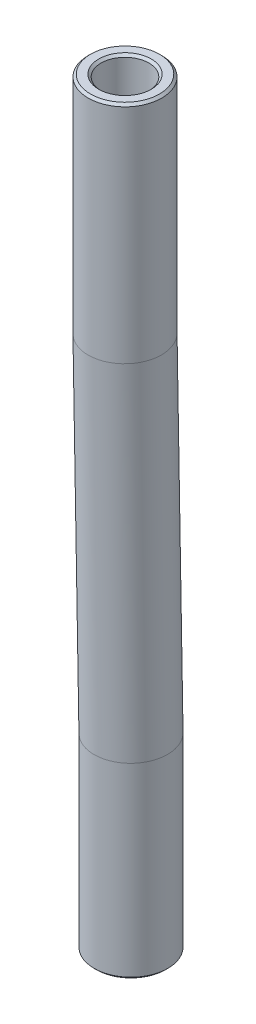
ISO-10303-21;
HEADER;
FILE_DESCRIPTION(('STEP AP214'),'2;1');
FILE_NAME('part.step','',(''),(''),'','','');
FILE_SCHEMA(('AUTOMOTIVE_DESIGN { 1 0 10303 214 1 1 1 1 }'));
ENDSEC;
DATA;
#1=APPLICATION_CONTEXT('core data for automotive mechanical design processes');
#2=APPLICATION_PROTOCOL_DEFINITION('international standard','automotive_design',2000,#1);
#3=PRODUCT_CONTEXT('',#1,'mechanical');
#4=PRODUCT('Part','Part','',(#3));
#5=PRODUCT_RELATED_PRODUCT_CATEGORY('part','',(#4));
#6=PRODUCT_DEFINITION_FORMATION('','',#4);
#7=PRODUCT_DEFINITION_CONTEXT('part definition',#1,'design');
#8=PRODUCT_DEFINITION('design','',#6,#7);
#9=PRODUCT_DEFINITION_SHAPE('','',#8);
#10=(LENGTH_UNIT() NAMED_UNIT(*) SI_UNIT(.MILLI.,.METRE.));
#11=(NAMED_UNIT(*) PLANE_ANGLE_UNIT() SI_UNIT($,.RADIAN.));
#12=(NAMED_UNIT(*) SI_UNIT($,.STERADIAN.) SOLID_ANGLE_UNIT());
#13=UNCERTAINTY_MEASURE_WITH_UNIT(LENGTH_MEASURE(1.E-05),#10,'distance_accuracy_value','');
#14=(GEOMETRIC_REPRESENTATION_CONTEXT(3) GLOBAL_UNCERTAINTY_ASSIGNED_CONTEXT((#13)) GLOBAL_UNIT_ASSIGNED_CONTEXT((#10,
#11,#12)) REPRESENTATION_CONTEXT('',''));
#15=CARTESIAN_POINT('',(0.,0.,0.));
#16=DIRECTION('',(0.,0.,1.));
#17=DIRECTION('',(1.,0.,0.));
#18=AXIS2_PLACEMENT_3D('',#15,#16,#17);
#19=CARTESIAN_POINT('',(93.8249999999999,-74.525,25.85));
#20=DIRECTION('',(0.,1.,0.));
#21=DIRECTION('',(0.,0.,1.));
#22=AXIS2_PLACEMENT_3D('',#19,#20,#21);
#23=CYLINDRICAL_SURFACE('',#22,2.);
#24=CARTESIAN_POINT('',(93.8249999999999,-62.252,25.85));
#25=DIRECTION('',(0.,1.,0.));
#26=DIRECTION('',(0.,0.,1.));
#27=AXIS2_PLACEMENT_3D('',#24,#25,#26);
#28=CIRCLE('',#27,2.);
#29=CARTESIAN_POINT('',(93.8249999999999,-62.252,27.85));
#30=VERTEX_POINT('',#29);
#31=EDGE_CURVE('E42',#30,#30,#28,.F.);
#32=ORIENTED_EDGE('',*,*,#31,.T.);
#33=EDGE_LOOP('',(#32));
#34=FACE_BOUND('',#33,.T.);
#35=CARTESIAN_POINT('',(93.8249999999999,-74.325,25.8499999999999));
#36=DIRECTION('',(0.,0.999963268554836,0.00857097083934706));
#37=DIRECTION('',(-1.01197381520543E-11,-0.00857097083934706,0.999963268554836));
#38=AXIS2_PLACEMENT_3D('',#35,#36,#37);
#39=ELLIPSE('',#38,2.00007346558882,2.);
#40=CARTESIAN_POINT('',(93.8249999999797,-74.3421425713501,27.8499999999999));
#41=VERTEX_POINT('',#40);
#42=EDGE_CURVE('E59',#41,#41,#39,.F.);
#43=ORIENTED_EDGE('',*,*,#42,.F.);
#44=EDGE_LOOP('',(#43));
#45=FACE_BOUND('',#44,.T.);
#46=ADVANCED_FACE('F33',(#34,#45),#23,.T.);
#47=CARTESIAN_POINT('',(93.8250000000032,-93.4822271790501,25.5215717375939));
#48=DIRECTION('',(-1.73471961206171E-13,0.999853076917742,0.0171413120304033));
#49=DIRECTION('',(0.,-0.0171413120304033,0.999853076917742));
#50=AXIS2_PLACEMENT_3D('',#47,#48,#49);
#51=CYLINDRICAL_SURFACE('',#50,2.);
#52=CARTESIAN_POINT('',(93.8250000000032,-93.2822565636665,25.525));
#53=DIRECTION('',(0.,0.999963268554836,0.00857097083934706));
#54=DIRECTION('',(1.01197381520543E-11,0.00857097083934706,-0.999963268554836));
#55=AXIS2_PLACEMENT_3D('',#52,#53,#54);
#56=ELLIPSE('',#55,2.00007346558882,2.);
#57=CARTESIAN_POINT('',(93.8250000000234,-93.2651139923164,23.525));
#58=VERTEX_POINT('',#57);
#59=EDGE_CURVE('E55',#58,#58,#56,.F.);
#60=ORIENTED_EDGE('',*,*,#59,.F.);
#61=EDGE_LOOP('',(#60));
#62=FACE_BOUND('',#61,.T.);
#63=ORIENTED_EDGE('',*,*,#42,.T.);
#64=EDGE_LOOP('',(#63));
#65=FACE_BOUND('',#64,.T.);
#66=ADVANCED_FACE('F131',(#62,#65),#51,.T.);
#67=CARTESIAN_POINT('',(93.8250000000032,-103.482256563667,25.525));
#68=DIRECTION('',(0.,1.,0.));
#69=DIRECTION('',(0.,0.,1.));
#70=AXIS2_PLACEMENT_3D('',#67,#68,#69);
#71=CYLINDRICAL_SURFACE('',#70,2.);
#72=CARTESIAN_POINT('',(93.8250000000032,-103.355256563667,25.525));
#73=DIRECTION('',(0.,1.,0.));
#74=DIRECTION('',(0.,0.,1.));
#75=AXIS2_PLACEMENT_3D('',#72,#73,#74);
#76=CIRCLE('',#75,2.);
#77=CARTESIAN_POINT('',(93.8250000000032,-103.355256563667,27.525));
#78=VERTEX_POINT('',#77);
#79=EDGE_CURVE('E65',#78,#78,#76,.T.);
#80=ORIENTED_EDGE('',*,*,#79,.T.);
#81=EDGE_LOOP('',(#80));
#82=FACE_BOUND('',#81,.T.);
#83=ORIENTED_EDGE('',*,*,#59,.T.);
#84=EDGE_LOOP('',(#83));
#85=FACE_BOUND('',#84,.T.);
#86=ADVANCED_FACE('F97',(#82,#85),#71,.T.);
#87=CARTESIAN_POINT('',(93.8249999999999,-62.125,25.85));
#88=DIRECTION('',(0.,1.,0.));
#89=DIRECTION('',(-1.,0.,0.));
#90=AXIS2_PLACEMENT_3D('',#87,#88,#89);
#91=PLANE('',#90);
#92=CARTESIAN_POINT('',(93.8249999999999,-62.125,25.85));
#93=DIRECTION('',(0.,1.,0.));
#94=DIRECTION('',(-1.,0.,0.));
#95=AXIS2_PLACEMENT_3D('',#92,#93,#94);
#96=CIRCLE('',#95,1.87300000000001);
#97=CARTESIAN_POINT('',(91.9519999999999,-62.125,25.85));
#98=VERTEX_POINT('',#97);
#99=EDGE_CURVE('E81',#98,#98,#96,.T.);
#100=ORIENTED_EDGE('',*,*,#99,.T.);
#101=EDGE_LOOP('',(#100));
#102=FACE_BOUND('',#101,.T.);
#103=CARTESIAN_POINT('',(93.8249999999999,-62.125,25.85));
#104=DIRECTION('',(0.,1.,0.));
#105=DIRECTION('',(-1.,0.,0.));
#106=AXIS2_PLACEMENT_3D('',#103,#104,#105);
#107=CIRCLE('',#106,1.42699999999997);
#108=CARTESIAN_POINT('',(92.3979999999999,-62.125,25.85));
#109=VERTEX_POINT('',#108);
#110=EDGE_CURVE('E78',#109,#109,#107,.F.);
#111=ORIENTED_EDGE('',*,*,#110,.T.);
#112=EDGE_LOOP('',(#111));
#113=FACE_BOUND('',#112,.T.);
#114=ADVANCED_FACE('F93',(#102,#113),#91,.T.);
#115=CARTESIAN_POINT('',(93.8250000000032,-103.482256563667,25.525));
#116=DIRECTION('',(0.,1.,0.));
#117=DIRECTION('',(-1.,0.,0.));
#118=AXIS2_PLACEMENT_3D('',#115,#116,#117);
#119=PLANE('',#118);
#120=CARTESIAN_POINT('',(93.8250000000032,-103.482256563667,25.525));
#121=DIRECTION('',(0.,1.,0.));
#122=DIRECTION('',(-1.,0.,0.));
#123=AXIS2_PLACEMENT_3D('',#120,#121,#122);
#124=CIRCLE('',#123,1.87299999999999);
#125=CARTESIAN_POINT('',(91.9520000000032,-103.482256563667,25.525));
#126=VERTEX_POINT('',#125);
#127=EDGE_CURVE('E72',#126,#126,#124,.F.);
#128=ORIENTED_EDGE('',*,*,#127,.T.);
#129=EDGE_LOOP('',(#128));
#130=FACE_BOUND('',#129,.T.);
#131=CARTESIAN_POINT('',(93.8250000000032,-103.482256563667,25.525));
#132=DIRECTION('',(0.,1.,0.));
#133=DIRECTION('',(-1.,0.,0.));
#134=AXIS2_PLACEMENT_3D('',#131,#132,#133);
#135=CIRCLE('',#134,1.42700000000001);
#136=CARTESIAN_POINT('',(92.3980000000032,-103.482256563667,25.525));
#137=VERTEX_POINT('',#136);
#138=EDGE_CURVE('E68',#137,#137,#135,.T.);
#139=ORIENTED_EDGE('',*,*,#138,.T.);
#140=EDGE_LOOP('',(#139));
#141=FACE_BOUND('',#140,.T.);
#142=ADVANCED_FACE('F96',(#130,#141),#119,.F.);
#143=CARTESIAN_POINT('',(93.8249999999999,-74.525,25.85));
#144=DIRECTION('',(0.,1.,0.));
#145=DIRECTION('',(0.,0.,1.));
#146=AXIS2_PLACEMENT_3D('',#143,#144,#145);
#147=CYLINDRICAL_SURFACE('',#146,1.29999999999999);
#148=CARTESIAN_POINT('',(93.8249999999999,-62.252,25.85));
#149=DIRECTION('',(0.,1.,0.));
#150=DIRECTION('',(0.,0.,1.));
#151=AXIS2_PLACEMENT_3D('',#148,#149,#150);
#152=CIRCLE('',#151,1.29999999999999);
#153=CARTESIAN_POINT('',(93.8249999999999,-62.252,27.1499999999999));
#154=VERTEX_POINT('',#153);
#155=EDGE_CURVE('E11',#154,#154,#152,.T.);
#156=ORIENTED_EDGE('',*,*,#155,.T.);
#157=EDGE_LOOP('',(#156));
#158=FACE_BOUND('',#157,.T.);
#159=CARTESIAN_POINT('',(93.8249999999999,-74.325,25.8499999999999));
#160=DIRECTION('',(0.,0.999963268554836,0.00857097083934706));
#161=DIRECTION('',(-1.01197381520543E-11,-0.00857097083934706,0.999963268554836));
#162=AXIS2_PLACEMENT_3D('',#159,#160,#161);
#163=ELLIPSE('',#162,1.30004775263273,1.29999999999999);
#164=CARTESIAN_POINT('',(93.8249999999868,-74.3361426713776,27.1499999999999));
#165=VERTEX_POINT('',#164);
#166=EDGE_CURVE('E48',#165,#165,#163,.T.);
#167=ORIENTED_EDGE('',*,*,#166,.F.);
#168=EDGE_LOOP('',(#167));
#169=FACE_BOUND('',#168,.T.);
#170=ADVANCED_FACE('F118',(#158,#169),#147,.F.);
#171=CARTESIAN_POINT('',(93.8250000000032,-93.4822271790501,25.5215717375939));
#172=DIRECTION('',(-1.73471961206171E-13,0.999853076917742,0.0171413120304033));
#173=DIRECTION('',(0.,-0.0171413120304033,0.999853076917742));
#174=AXIS2_PLACEMENT_3D('',#171,#172,#173);
#175=CYLINDRICAL_SURFACE('',#174,1.29999999999999);
#176=CARTESIAN_POINT('',(93.8250000000032,-93.2822565636665,25.525));
#177=DIRECTION('',(0.,0.999963268554836,0.00857097083934706));
#178=DIRECTION('',(1.01197381520543E-11,0.00857097083934706,-0.999963268554836));
#179=AXIS2_PLACEMENT_3D('',#176,#177,#178);
#180=ELLIPSE('',#179,1.30004775263273,1.29999999999999);
#181=CARTESIAN_POINT('',(93.8250000000163,-93.271113892289,24.225));
#182=VERTEX_POINT('',#181);
#183=EDGE_CURVE('E69',#182,#182,#180,.T.);
#184=ORIENTED_EDGE('',*,*,#183,.F.);
#185=EDGE_LOOP('',(#184));
#186=FACE_BOUND('',#185,.T.);
#187=ORIENTED_EDGE('',*,*,#166,.T.);
#188=EDGE_LOOP('',(#187));
#189=FACE_BOUND('',#188,.T.);
#190=ADVANCED_FACE('F109',(#186,#189),#175,.F.);
#191=CARTESIAN_POINT('',(93.8250000000032,-103.482256563667,25.525));
#192=DIRECTION('',(0.,1.,0.));
#193=DIRECTION('',(0.,0.,1.));
#194=AXIS2_PLACEMENT_3D('',#191,#192,#193);
#195=CYLINDRICAL_SURFACE('',#194,1.29999999999999);
#196=CARTESIAN_POINT('',(93.8250000000032,-103.355256563667,25.525));
#197=DIRECTION('',(0.,1.,0.));
#198=DIRECTION('',(0.,0.,1.));
#199=AXIS2_PLACEMENT_3D('',#196,#197,#198);
#200=CIRCLE('',#199,1.29999999999999);
#201=CARTESIAN_POINT('',(93.8250000000032,-103.355256563667,26.825));
#202=VERTEX_POINT('',#201);
#203=EDGE_CURVE('E75',#202,#202,#200,.F.);
#204=ORIENTED_EDGE('',*,*,#203,.T.);
#205=EDGE_LOOP('',(#204));
#206=FACE_BOUND('',#205,.T.);
#207=ORIENTED_EDGE('',*,*,#183,.T.);
#208=EDGE_LOOP('',(#207));
#209=FACE_BOUND('',#208,.T.);
#210=ADVANCED_FACE('F106',(#206,#209),#195,.F.);
#211=CARTESIAN_POINT('',(93.8250000000032,-103.355256563667,25.525));
#212=DIRECTION('',(0.,1.,0.));
#213=DIRECTION('',(0.,0.,1.));
#214=AXIS2_PLACEMENT_3D('',#211,#212,#213);
#215=CONICAL_SURFACE('',#214,2.,0.785398163397537);
#216=ORIENTED_EDGE('',*,*,#127,.F.);
#217=EDGE_LOOP('',(#216));
#218=FACE_BOUND('',#217,.T.);
#219=ORIENTED_EDGE('',*,*,#79,.F.);
#220=EDGE_LOOP('',(#219));
#221=FACE_BOUND('',#220,.T.);
#222=ADVANCED_FACE('F108',(#218,#221),#215,.T.);
#223=CARTESIAN_POINT('',(93.8250000000032,-103.355256563667,25.525));
#224=DIRECTION('',(0.,-1.,0.));
#225=DIRECTION('',(0.,0.,-1.));
#226=AXIS2_PLACEMENT_3D('',#223,#224,#225);
#227=CONICAL_SURFACE('',#226,1.29999999999999,0.785398163397507);
#228=ORIENTED_EDGE('',*,*,#138,.F.);
#229=EDGE_LOOP('',(#228));
#230=FACE_BOUND('',#229,.T.);
#231=ORIENTED_EDGE('',*,*,#203,.F.);
#232=EDGE_LOOP('',(#231));
#233=FACE_BOUND('',#232,.T.);
#234=ADVANCED_FACE('F90',(#230,#233),#227,.F.);
#235=CARTESIAN_POINT('',(93.8249999999999,-62.125,25.85));
#236=DIRECTION('',(0.,-1.,0.));
#237=DIRECTION('',(0.,0.,-1.));
#238=AXIS2_PLACEMENT_3D('',#235,#236,#237);
#239=CONICAL_SURFACE('',#238,1.87300000000001,0.785398163397401);
#240=ORIENTED_EDGE('',*,*,#31,.F.);
#241=EDGE_LOOP('',(#240));
#242=FACE_BOUND('',#241,.T.);
#243=ORIENTED_EDGE('',*,*,#99,.F.);
#244=EDGE_LOOP('',(#243));
#245=FACE_BOUND('',#244,.T.);
#246=ADVANCED_FACE('F87',(#242,#245),#239,.T.);
#247=CARTESIAN_POINT('',(93.8249999999999,-62.125,25.85));
#248=DIRECTION('',(0.,1.,0.));
#249=DIRECTION('',(0.,0.,1.));
#250=AXIS2_PLACEMENT_3D('',#247,#248,#249);
#251=CONICAL_SURFACE('',#250,1.42699999999997,0.785398163397425);
#252=ORIENTED_EDGE('',*,*,#155,.F.);
#253=EDGE_LOOP('',(#252));
#254=FACE_BOUND('',#253,.T.);
#255=ORIENTED_EDGE('',*,*,#110,.F.);
#256=EDGE_LOOP('',(#255));
#257=FACE_BOUND('',#256,.T.);
#258=ADVANCED_FACE('F35',(#254,#257),#251,.F.);
#259=CLOSED_SHELL('',(#46,#66,#86,#114,#142,#170,#190,#210,#222,#234,#246,#258));
#260=MANIFOLD_SOLID_BREP('B2',#259);
#261=ADVANCED_BREP_SHAPE_REPRESENTATION('',(#18,#260),#14);
#262=SHAPE_DEFINITION_REPRESENTATION(#9,#261);
ENDSEC;
END-ISO-10303-21;
